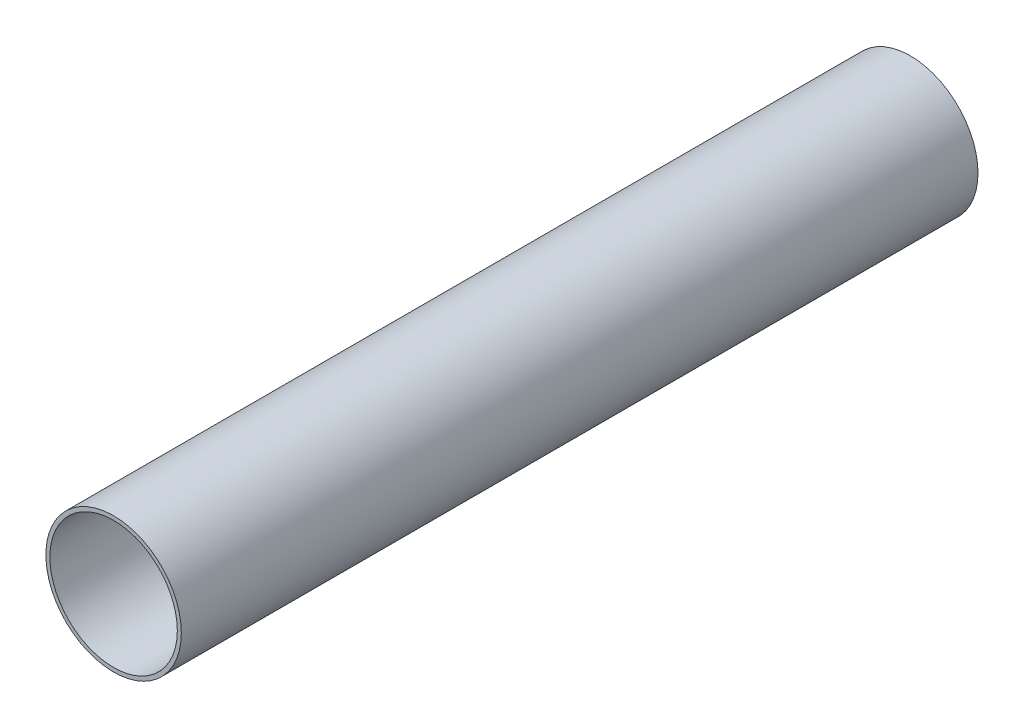
ISO-10303-21;
HEADER;
FILE_DESCRIPTION(('STEP AP214'),'2;1');
FILE_NAME('part.step','',(''),(''),'','','');
FILE_SCHEMA(('AUTOMOTIVE_DESIGN { 1 0 10303 214 1 1 1 1 }'));
ENDSEC;
DATA;
#1=APPLICATION_CONTEXT('core data for automotive mechanical design processes');
#2=APPLICATION_PROTOCOL_DEFINITION('international standard','automotive_design',2000,#1);
#3=PRODUCT_CONTEXT('',#1,'mechanical');
#4=PRODUCT('Part','Part','',(#3));
#5=PRODUCT_RELATED_PRODUCT_CATEGORY('part','',(#4));
#6=PRODUCT_DEFINITION_FORMATION('','',#4);
#7=PRODUCT_DEFINITION_CONTEXT('part definition',#1,'design');
#8=PRODUCT_DEFINITION('design','',#6,#7);
#9=PRODUCT_DEFINITION_SHAPE('','',#8);
#10=(LENGTH_UNIT() NAMED_UNIT(*) SI_UNIT(.MILLI.,.METRE.));
#11=(NAMED_UNIT(*) PLANE_ANGLE_UNIT() SI_UNIT($,.RADIAN.));
#12=(NAMED_UNIT(*) SI_UNIT($,.STERADIAN.) SOLID_ANGLE_UNIT());
#13=UNCERTAINTY_MEASURE_WITH_UNIT(LENGTH_MEASURE(1.E-05),#10,'distance_accuracy_value','');
#14=(GEOMETRIC_REPRESENTATION_CONTEXT(3) GLOBAL_UNCERTAINTY_ASSIGNED_CONTEXT((#13)) GLOBAL_UNIT_ASSIGNED_CONTEXT((#10,
#11,#12)) REPRESENTATION_CONTEXT('',''));
#15=CARTESIAN_POINT('',(0.,0.,0.));
#16=DIRECTION('',(0.,0.,1.));
#17=DIRECTION('',(1.,0.,0.));
#18=AXIS2_PLACEMENT_3D('',#15,#16,#17);
#19=CARTESIAN_POINT('',(0.,0.,200.));
#20=DIRECTION('',(0.,0.,1.));
#21=DIRECTION('',(1.,0.,0.));
#22=AXIS2_PLACEMENT_3D('',#19,#20,#21);
#23=PLANE('',#22);
#24=CARTESIAN_POINT('',(0.,0.,200.));
#25=DIRECTION('',(0.,0.,1.));
#26=DIRECTION('',(1.,0.,0.));
#27=AXIS2_PLACEMENT_3D('',#24,#25,#26);
#28=CIRCLE('',#27,17.);
#29=CARTESIAN_POINT('',(17.,0.,200.));
#30=VERTEX_POINT('',#29);
#31=EDGE_CURVE('E10',#30,#30,#28,.T.);
#32=ORIENTED_EDGE('',*,*,#31,.T.);
#33=EDGE_LOOP('',(#32));
#34=FACE_BOUND('',#33,.T.);
#35=CARTESIAN_POINT('',(0.,0.,200.));
#36=DIRECTION('',(0.,0.,1.));
#37=DIRECTION('',(1.,0.,0.));
#38=AXIS2_PLACEMENT_3D('',#35,#36,#37);
#39=CIRCLE('',#38,16.);
#40=CARTESIAN_POINT('',(16.,0.,200.));
#41=VERTEX_POINT('',#40);
#42=EDGE_CURVE('E50',#41,#41,#39,.T.);
#43=ORIENTED_EDGE('',*,*,#42,.F.);
#44=EDGE_LOOP('',(#43));
#45=FACE_BOUND('',#44,.T.);
#46=ADVANCED_FACE('F37',(#34,#45),#23,.T.);
#47=CARTESIAN_POINT('',(0.,0.,0.));
#48=DIRECTION('',(0.,0.,1.));
#49=DIRECTION('',(1.,0.,0.));
#50=AXIS2_PLACEMENT_3D('',#47,#48,#49);
#51=PLANE('',#50);
#52=CARTESIAN_POINT('',(0.,0.,0.));
#53=DIRECTION('',(0.,0.,1.));
#54=DIRECTION('',(1.,0.,0.));
#55=AXIS2_PLACEMENT_3D('',#52,#53,#54);
#56=CIRCLE('',#55,17.);
#57=CARTESIAN_POINT('',(17.,0.,0.));
#58=VERTEX_POINT('',#57);
#59=EDGE_CURVE('E41',#58,#58,#56,.T.);
#60=ORIENTED_EDGE('',*,*,#59,.F.);
#61=EDGE_LOOP('',(#60));
#62=FACE_BOUND('',#61,.T.);
#63=CARTESIAN_POINT('',(0.,0.,0.));
#64=DIRECTION('',(0.,0.,1.));
#65=DIRECTION('',(1.,0.,0.));
#66=AXIS2_PLACEMENT_3D('',#63,#64,#65);
#67=CIRCLE('',#66,16.);
#68=CARTESIAN_POINT('',(16.,0.,0.));
#69=VERTEX_POINT('',#68);
#70=EDGE_CURVE('E52',#69,#69,#67,.T.);
#71=ORIENTED_EDGE('',*,*,#70,.T.);
#72=EDGE_LOOP('',(#71));
#73=FACE_BOUND('',#72,.T.);
#74=ADVANCED_FACE('F64',(#62,#73),#51,.F.);
#75=CARTESIAN_POINT('',(0.,0.,200.));
#76=DIRECTION('',(0.,0.,-1.));
#77=DIRECTION('',(-1.,0.,0.));
#78=AXIS2_PLACEMENT_3D('',#75,#76,#77);
#79=CYLINDRICAL_SURFACE('',#78,17.);
#80=ORIENTED_EDGE('',*,*,#31,.F.);
#81=EDGE_LOOP('',(#80));
#82=FACE_BOUND('',#81,.T.);
#83=ORIENTED_EDGE('',*,*,#59,.T.);
#84=EDGE_LOOP('',(#83));
#85=FACE_BOUND('',#84,.T.);
#86=ADVANCED_FACE('F39',(#82,#85),#79,.T.);
#87=CARTESIAN_POINT('',(0.,0.,200.));
#88=DIRECTION('',(0.,0.,-1.));
#89=DIRECTION('',(-1.,0.,0.));
#90=AXIS2_PLACEMENT_3D('',#87,#88,#89);
#91=CYLINDRICAL_SURFACE('',#90,16.);
#92=ORIENTED_EDGE('',*,*,#42,.T.);
#93=EDGE_LOOP('',(#92));
#94=FACE_BOUND('',#93,.T.);
#95=ORIENTED_EDGE('',*,*,#70,.F.);
#96=EDGE_LOOP('',(#95));
#97=FACE_BOUND('',#96,.T.);
#98=ADVANCED_FACE('F60',(#94,#97),#91,.F.);
#99=CLOSED_SHELL('',(#46,#74,#86,#98));
#100=MANIFOLD_SOLID_BREP('B2',#99);
#101=ADVANCED_BREP_SHAPE_REPRESENTATION('',(#18,#100),#14);
#102=SHAPE_DEFINITION_REPRESENTATION(#9,#101);
ENDSEC;
END-ISO-10303-21;
